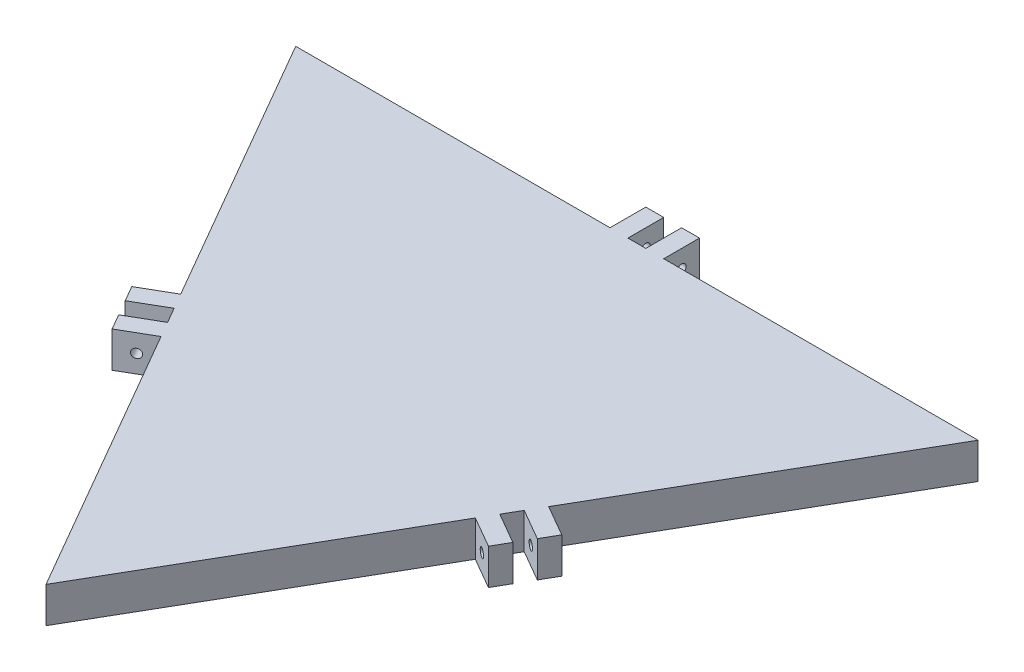
ISO-10303-21;
HEADER;
FILE_DESCRIPTION(('STEP AP214'),'2;1');
FILE_NAME('part.step','',(''),(''),'','','');
FILE_SCHEMA(('AUTOMOTIVE_DESIGN { 1 0 10303 214 1 1 1 1 }'));
ENDSEC;
DATA;
#1=APPLICATION_CONTEXT('core data for automotive mechanical design processes');
#2=APPLICATION_PROTOCOL_DEFINITION('international standard','automotive_design',2000,#1);
#3=PRODUCT_CONTEXT('',#1,'mechanical');
#4=PRODUCT('Part','Part','',(#3));
#5=PRODUCT_RELATED_PRODUCT_CATEGORY('part','',(#4));
#6=PRODUCT_DEFINITION_FORMATION('','',#4);
#7=PRODUCT_DEFINITION_CONTEXT('part definition',#1,'design');
#8=PRODUCT_DEFINITION('design','',#6,#7);
#9=PRODUCT_DEFINITION_SHAPE('','',#8);
#10=(LENGTH_UNIT() NAMED_UNIT(*) SI_UNIT(.MILLI.,.METRE.));
#11=(NAMED_UNIT(*) PLANE_ANGLE_UNIT() SI_UNIT($,.RADIAN.));
#12=(NAMED_UNIT(*) SI_UNIT($,.STERADIAN.) SOLID_ANGLE_UNIT());
#13=UNCERTAINTY_MEASURE_WITH_UNIT(LENGTH_MEASURE(1.E-05),#10,'distance_accuracy_value','');
#14=(GEOMETRIC_REPRESENTATION_CONTEXT(3) GLOBAL_UNCERTAINTY_ASSIGNED_CONTEXT((#13)) GLOBAL_UNIT_ASSIGNED_CONTEXT((#10,
#11,#12)) REPRESENTATION_CONTEXT('',''));
#15=CARTESIAN_POINT('',(0.,0.,0.));
#16=DIRECTION('',(0.,0.,1.));
#17=DIRECTION('',(1.,0.,0.));
#18=AXIS2_PLACEMENT_3D('',#15,#16,#17);
#19=CARTESIAN_POINT('',(-190.55,20.,-110.014093794083));
#20=DIRECTION('',(0.,0.,-1.));
#21=DIRECTION('',(-1.,0.,0.));
#22=AXIS2_PLACEMENT_3D('',#19,#20,#21);
#23=PLANE('',#22);
#24=DIRECTION('',(0.,-1.,0.));
#25=VECTOR('',#24,1.);
#26=CARTESIAN_POINT('',(4.99999999999988,20.,-110.014093794083));
#27=LINE('',#26,#25);
#28=CARTESIAN_POINT('',(4.99999999999987,20.,-110.014093794083));
#29=VERTEX_POINT('',#28);
#30=CARTESIAN_POINT('',(4.99999999999987,0.,-110.014093794083));
#31=VERTEX_POINT('',#30);
#32=EDGE_CURVE('E91',#29,#31,#27,.T.);
#33=ORIENTED_EDGE('',*,*,#32,.T.);
#34=DIRECTION('',(1.,0.,0.));
#35=VECTOR('',#34,1.);
#36=CARTESIAN_POINT('',(-190.55,0.,-110.014093794083));
#37=LINE('',#36,#35);
#38=CARTESIAN_POINT('',(-5.00000000000013,0.,-110.014093794083));
#39=VERTEX_POINT('',#38);
#40=EDGE_CURVE('E524',#39,#31,#37,.T.);
#41=ORIENTED_EDGE('',*,*,#40,.F.);
#42=DIRECTION('',(0.,1.,0.));
#43=VECTOR('',#42,1.);
#44=CARTESIAN_POINT('',(-5.00000000000013,20.,-110.014093794083));
#45=LINE('',#44,#43);
#46=CARTESIAN_POINT('',(-5.00000000000013,20.,-110.014093794083));
#47=VERTEX_POINT('',#46);
#48=EDGE_CURVE('E258',#39,#47,#45,.T.);
#49=ORIENTED_EDGE('',*,*,#48,.T.);
#50=DIRECTION('',(1.,0.,0.));
#51=VECTOR('',#50,1.);
#52=CARTESIAN_POINT('',(-190.55,20.,-110.014093794083));
#53=LINE('',#52,#51);
#54=EDGE_CURVE('E519',#47,#29,#53,.T.);
#55=ORIENTED_EDGE('',*,*,#54,.T.);
#56=EDGE_LOOP('',(#33,#41,#49,#55));
#57=FACE_BOUND('',#56,.T.);
#58=ADVANCED_FACE('F65',(#57),#23,.T.);
#59=DIRECTION('',(0.,1.,0.));
#60=VECTOR('',#59,1.);
#61=CARTESIAN_POINT('',(14.9999999999999,20.,-110.014093794083));
#62=LINE('',#61,#60);
#63=CARTESIAN_POINT('',(14.9999999999999,0.,-110.014093794083));
#64=VERTEX_POINT('',#63);
#65=CARTESIAN_POINT('',(14.9999999999999,20.,-110.014093794083));
#66=VERTEX_POINT('',#65);
#67=EDGE_CURVE('E270',#64,#66,#62,.T.);
#68=ORIENTED_EDGE('',*,*,#67,.T.);
#69=CARTESIAN_POINT('',(190.55,20.,-110.014093794083));
#70=VERTEX_POINT('',#69);
#71=EDGE_CURVE('E520',#66,#70,#53,.T.);
#72=ORIENTED_EDGE('',*,*,#71,.T.);
#73=DIRECTION('',(0.,-1.,0.));
#74=VECTOR('',#73,1.);
#75=CARTESIAN_POINT('',(190.55,20.,-110.014093794083));
#76=LINE('',#75,#74);
#77=CARTESIAN_POINT('',(190.55,0.,-110.014093794083));
#78=VERTEX_POINT('',#77);
#79=EDGE_CURVE('E69',#70,#78,#76,.T.);
#80=ORIENTED_EDGE('',*,*,#79,.T.);
#81=EDGE_CURVE('E83',#64,#78,#37,.T.);
#82=ORIENTED_EDGE('',*,*,#81,.F.);
#83=EDGE_LOOP('',(#68,#72,#80,#82));
#84=FACE_BOUND('',#83,.T.);
#85=ADVANCED_FACE('F67',(#84),#23,.T.);
#86=CARTESIAN_POINT('',(-190.55,20.,-110.014093794083));
#87=VERTEX_POINT('',#86);
#88=CARTESIAN_POINT('',(-15.0000000000001,20.,-110.014093794083));
#89=VERTEX_POINT('',#88);
#90=EDGE_CURVE('E514',#87,#89,#53,.T.);
#91=ORIENTED_EDGE('',*,*,#90,.T.);
#92=DIRECTION('',(0.,-1.,0.));
#93=VECTOR('',#92,1.);
#94=CARTESIAN_POINT('',(-15.0000000000001,20.,-110.014093794083));
#95=LINE('',#94,#93);
#96=CARTESIAN_POINT('',(-15.0000000000001,0.,-110.014093794083));
#97=VERTEX_POINT('',#96);
#98=EDGE_CURVE('E302',#89,#97,#95,.T.);
#99=ORIENTED_EDGE('',*,*,#98,.T.);
#100=CARTESIAN_POINT('',(-190.55,0.,-110.014093794083));
#101=VERTEX_POINT('',#100);
#102=EDGE_CURVE('E521',#101,#97,#37,.T.);
#103=ORIENTED_EDGE('',*,*,#102,.F.);
#104=DIRECTION('',(0.,-1.,0.));
#105=VECTOR('',#104,1.);
#106=CARTESIAN_POINT('',(-190.55,20.,-110.014093794083));
#107=LINE('',#106,#105);
#108=EDGE_CURVE('E518',#87,#101,#107,.T.);
#109=ORIENTED_EDGE('',*,*,#108,.F.);
#110=EDGE_LOOP('',(#91,#99,#103,#109));
#111=FACE_BOUND('',#110,.T.);
#112=ADVANCED_FACE('F592',(#111),#23,.T.);
#113=CARTESIAN_POINT('',(-95.275,20.,55.0070468970416));
#114=DIRECTION('',(-0.866025403784439,0.,0.5));
#115=DIRECTION('',(0.5,0.,0.866025403784439));
#116=AXIS2_PLACEMENT_3D('',#113,#114,#115);
#117=PLANE('',#116);
#118=DIRECTION('',(0.,-1.,0.));
#119=VECTOR('',#118,1.);
#120=CARTESIAN_POINT('',(-97.775,20.,50.6769198781195));
#121=LINE('',#120,#119);
#122=CARTESIAN_POINT('',(-97.7749999999999,20.,50.6769198781195));
#123=VERTEX_POINT('',#122);
#124=CARTESIAN_POINT('',(-97.7749999999999,0.,50.6769198781195));
#125=VERTEX_POINT('',#124);
#126=EDGE_CURVE('E332',#123,#125,#121,.T.);
#127=ORIENTED_EDGE('',*,*,#126,.T.);
#128=DIRECTION('',(-0.5,0.,-0.866025403784439));
#129=VECTOR('',#128,1.);
#130=CARTESIAN_POINT('',(-95.275,0.,55.0070468970416));
#131=LINE('',#130,#129);
#132=CARTESIAN_POINT('',(-92.775,0.,59.3371739159639));
#133=VERTEX_POINT('',#132);
#134=EDGE_CURVE('E512',#133,#125,#131,.T.);
#135=ORIENTED_EDGE('',*,*,#134,.F.);
#136=DIRECTION('',(0.,1.,0.));
#137=VECTOR('',#136,1.);
#138=CARTESIAN_POINT('',(-92.775,20.,59.3371739159639));
#139=LINE('',#138,#137);
#140=CARTESIAN_POINT('',(-92.775,20.,59.3371739159639));
#141=VERTEX_POINT('',#140);
#142=EDGE_CURVE('E371',#133,#141,#139,.T.);
#143=ORIENTED_EDGE('',*,*,#142,.T.);
#144=DIRECTION('',(-0.5,0.,-0.866025403784439));
#145=VECTOR('',#144,1.);
#146=CARTESIAN_POINT('',(-95.275,20.,55.0070468970416));
#147=LINE('',#146,#145);
#148=EDGE_CURVE('E502',#141,#123,#147,.T.);
#149=ORIENTED_EDGE('',*,*,#148,.T.);
#150=EDGE_LOOP('',(#127,#135,#143,#149));
#151=FACE_BOUND('',#150,.T.);
#152=ADVANCED_FACE('F598',(#151),#117,.T.);
#153=DIRECTION('',(0.,1.,0.));
#154=VECTOR('',#153,1.);
#155=CARTESIAN_POINT('',(-102.775,20.,42.0166658402751));
#156=LINE('',#155,#154);
#157=CARTESIAN_POINT('',(-102.775,0.,42.0166658402751));
#158=VERTEX_POINT('',#157);
#159=CARTESIAN_POINT('',(-102.775,20.,42.0166658402751));
#160=VERTEX_POINT('',#159);
#161=EDGE_CURVE('E338',#158,#160,#156,.T.);
#162=ORIENTED_EDGE('',*,*,#161,.T.);
#163=EDGE_CURVE('E496',#160,#87,#147,.T.);
#164=ORIENTED_EDGE('',*,*,#163,.T.);
#165=ORIENTED_EDGE('',*,*,#108,.T.);
#166=EDGE_CURVE('E506',#158,#101,#131,.T.);
#167=ORIENTED_EDGE('',*,*,#166,.F.);
#168=EDGE_LOOP('',(#162,#164,#165,#167));
#169=FACE_BOUND('',#168,.T.);
#170=ADVANCED_FACE('F603',(#169),#117,.T.);
#171=CARTESIAN_POINT('',(0.,20.,220.028187588166));
#172=VERTEX_POINT('',#171);
#173=CARTESIAN_POINT('',(-87.775,20.,67.9974279538083));
#174=VERTEX_POINT('',#173);
#175=EDGE_CURVE('E75',#172,#174,#147,.T.);
#176=ORIENTED_EDGE('',*,*,#175,.T.);
#177=DIRECTION('',(0.,-1.,0.));
#178=VECTOR('',#177,1.);
#179=CARTESIAN_POINT('',(-87.775,20.,67.9974279538083));
#180=LINE('',#179,#178);
#181=CARTESIAN_POINT('',(-87.7749999999999,0.,67.9974279538083));
#182=VERTEX_POINT('',#181);
#183=EDGE_CURVE('E377',#174,#182,#180,.T.);
#184=ORIENTED_EDGE('',*,*,#183,.T.);
#185=CARTESIAN_POINT('',(0.,0.,220.028187588166));
#186=VERTEX_POINT('',#185);
#187=EDGE_CURVE('E509',#186,#182,#131,.T.);
#188=ORIENTED_EDGE('',*,*,#187,.F.);
#189=DIRECTION('',(0.,-1.,0.));
#190=VECTOR('',#189,1.);
#191=CARTESIAN_POINT('',(0.,20.,220.028187588166));
#192=LINE('',#191,#190);
#193=EDGE_CURVE('E12',#172,#186,#192,.T.);
#194=ORIENTED_EDGE('',*,*,#193,.F.);
#195=EDGE_LOOP('',(#176,#184,#188,#194));
#196=FACE_BOUND('',#195,.T.);
#197=ADVANCED_FACE('F568',(#196),#117,.T.);
#198=CARTESIAN_POINT('',(95.275,20.,55.0070468970416));
#199=DIRECTION('',(-0.866025403784439,0.,-0.5));
#200=DIRECTION('',(-0.5,0.,0.866025403784439));
#201=AXIS2_PLACEMENT_3D('',#198,#199,#200);
#202=PLANE('',#201);
#203=DIRECTION('',(0.,-1.,0.));
#204=VECTOR('',#203,1.);
#205=CARTESIAN_POINT('',(97.775,20.,50.6769198781195));
#206=LINE('',#205,#204);
#207=CARTESIAN_POINT('',(97.775,20.,50.6769198781195));
#208=VERTEX_POINT('',#207);
#209=CARTESIAN_POINT('',(97.775,0.,50.6769198781195));
#210=VERTEX_POINT('',#209);
#211=EDGE_CURVE('E440',#208,#210,#206,.T.);
#212=ORIENTED_EDGE('',*,*,#211,.F.);
#213=DIRECTION('',(0.5,0.,-0.866025403784439));
#214=VECTOR('',#213,1.);
#215=CARTESIAN_POINT('',(95.275,20.,55.0070468970416));
#216=LINE('',#215,#214);
#217=CARTESIAN_POINT('',(92.775,20.,59.3371739159639));
#218=VERTEX_POINT('',#217);
#219=EDGE_CURVE('E497',#218,#208,#216,.T.);
#220=ORIENTED_EDGE('',*,*,#219,.F.);
#221=DIRECTION('',(0.,1.,0.));
#222=VECTOR('',#221,1.);
#223=CARTESIAN_POINT('',(92.775,20.,59.3371739159639));
#224=LINE('',#223,#222);
#225=CARTESIAN_POINT('',(92.775,0.,59.3371739159639));
#226=VERTEX_POINT('',#225);
#227=EDGE_CURVE('E445',#226,#218,#224,.T.);
#228=ORIENTED_EDGE('',*,*,#227,.F.);
#229=DIRECTION('',(0.5,0.,-0.866025403784439));
#230=VECTOR('',#229,1.);
#231=CARTESIAN_POINT('',(95.275,0.,55.0070468970416));
#232=LINE('',#231,#230);
#233=EDGE_CURVE('E507',#226,#210,#232,.T.);
#234=ORIENTED_EDGE('',*,*,#233,.T.);
#235=EDGE_LOOP('',(#212,#220,#228,#234));
#236=FACE_BOUND('',#235,.T.);
#237=ADVANCED_FACE('F542',(#236),#202,.F.);
#238=DIRECTION('',(0.,1.,0.));
#239=VECTOR('',#238,1.);
#240=CARTESIAN_POINT('',(102.775,20.,42.0166658402751));
#241=LINE('',#240,#239);
#242=CARTESIAN_POINT('',(102.775,0.,42.0166658402751));
#243=VERTEX_POINT('',#242);
#244=CARTESIAN_POINT('',(102.775,20.,42.0166658402751));
#245=VERTEX_POINT('',#244);
#246=EDGE_CURVE('E436',#243,#245,#241,.T.);
#247=ORIENTED_EDGE('',*,*,#246,.F.);
#248=EDGE_CURVE('E508',#243,#78,#232,.T.);
#249=ORIENTED_EDGE('',*,*,#248,.T.);
#250=ORIENTED_EDGE('',*,*,#79,.F.);
#251=EDGE_CURVE('E498',#245,#70,#216,.T.);
#252=ORIENTED_EDGE('',*,*,#251,.F.);
#253=EDGE_LOOP('',(#247,#249,#250,#252));
#254=FACE_BOUND('',#253,.T.);
#255=ADVANCED_FACE('F631',(#254),#202,.F.);
#256=DIRECTION('',(0.,-1.,0.));
#257=VECTOR('',#256,1.);
#258=CARTESIAN_POINT('',(87.775,20.,67.9974279538083));
#259=LINE('',#258,#257);
#260=CARTESIAN_POINT('',(87.775,20.,67.9974279538083));
#261=VERTEX_POINT('',#260);
#262=CARTESIAN_POINT('',(87.775,0.,67.9974279538083));
#263=VERTEX_POINT('',#262);
#264=EDGE_CURVE('E462',#261,#263,#259,.T.);
#265=ORIENTED_EDGE('',*,*,#264,.F.);
#266=EDGE_CURVE('E493',#172,#261,#216,.T.);
#267=ORIENTED_EDGE('',*,*,#266,.F.);
#268=ORIENTED_EDGE('',*,*,#193,.T.);
#269=EDGE_CURVE('E503',#186,#263,#232,.T.);
#270=ORIENTED_EDGE('',*,*,#269,.T.);
#271=EDGE_LOOP('',(#265,#267,#268,#270));
#272=FACE_BOUND('',#271,.T.);
#273=ADVANCED_FACE('F564',(#272),#202,.F.);
#274=CARTESIAN_POINT('',(0.,0.,0.));
#275=DIRECTION('',(0.,1.,0.));
#276=DIRECTION('',(0.,0.,1.));
#277=AXIS2_PLACEMENT_3D('',#274,#275,#276);
#278=PLANE('',#277);
#279=ORIENTED_EDGE('',*,*,#269,.F.);
#280=ORIENTED_EDGE('',*,*,#187,.T.);
#281=DIRECTION('',(0.866025403784438,0.,-0.5));
#282=VECTOR('',#281,1.);
#283=CARTESIAN_POINT('',(-105.095508075689,0.,77.9974279538083));
#284=LINE('',#283,#282);
#285=CARTESIAN_POINT('',(-105.095508075689,0.,77.9974279538083));
#286=VERTEX_POINT('',#285);
#287=EDGE_CURVE('E401',#286,#182,#284,.T.);
#288=ORIENTED_EDGE('',*,*,#287,.F.);
#289=DIRECTION('',(-0.500000000000001,0.,-0.866025403784438));
#290=VECTOR('',#289,1.);
#291=CARTESIAN_POINT('',(-110.095508075689,0.,69.3371739159639));
#292=LINE('',#291,#290);
#293=CARTESIAN_POINT('',(-110.095508075689,0.,69.3371739159639));
#294=VERTEX_POINT('',#293);
#295=EDGE_CURVE('E376',#286,#294,#292,.T.);
#296=ORIENTED_EDGE('',*,*,#295,.T.);
#297=DIRECTION('',(0.866025403784438,0.,-0.5));
#298=VECTOR('',#297,1.);
#299=CARTESIAN_POINT('',(-110.095508075689,0.,69.3371739159639));
#300=LINE('',#299,#298);
#301=EDGE_CURVE('E404',#294,#133,#300,.T.);
#302=ORIENTED_EDGE('',*,*,#301,.T.);
#303=ORIENTED_EDGE('',*,*,#134,.T.);
#304=DIRECTION('',(0.866025403784438,0.,-0.5));
#305=VECTOR('',#304,1.);
#306=CARTESIAN_POINT('',(-115.095508075689,0.,60.6769198781195));
#307=LINE('',#306,#305);
#308=CARTESIAN_POINT('',(-115.095508075689,0.,60.6769198781195));
#309=VERTEX_POINT('',#308);
#310=EDGE_CURVE('E350',#309,#125,#307,.T.);
#311=ORIENTED_EDGE('',*,*,#310,.F.);
#312=DIRECTION('',(-0.5,0.,-0.866025403784439));
#313=VECTOR('',#312,1.);
#314=CARTESIAN_POINT('',(-115.095508075689,0.,60.6769198781195));
#315=LINE('',#314,#313);
#316=CARTESIAN_POINT('',(-120.095508075689,0.,52.0166658402751));
#317=VERTEX_POINT('',#316);
#318=EDGE_CURVE('E346',#309,#317,#315,.T.);
#319=ORIENTED_EDGE('',*,*,#318,.T.);
#320=DIRECTION('',(0.866025403784438,0.,-0.5));
#321=VECTOR('',#320,1.);
#322=CARTESIAN_POINT('',(-120.095508075689,0.,52.0166658402751));
#323=LINE('',#322,#321);
#324=EDGE_CURVE('E359',#317,#158,#323,.T.);
#325=ORIENTED_EDGE('',*,*,#324,.T.);
#326=ORIENTED_EDGE('',*,*,#166,.T.);
#327=ORIENTED_EDGE('',*,*,#102,.T.);
#328=DIRECTION('',(0.,0.,1.));
#329=VECTOR('',#328,1.);
#330=CARTESIAN_POINT('',(-15.0000000000001,0.,-130.014093794083));
#331=LINE('',#330,#329);
#332=CARTESIAN_POINT('',(-15.0000000000001,0.,-130.014093794083));
#333=VERTEX_POINT('',#332);
#334=EDGE_CURVE('E326',#333,#97,#331,.T.);
#335=ORIENTED_EDGE('',*,*,#334,.F.);
#336=DIRECTION('',(1.,0.,0.));
#337=VECTOR('',#336,1.);
#338=CARTESIAN_POINT('',(-5.00000000000014,0.,-130.014093794083));
#339=LINE('',#338,#337);
#340=CARTESIAN_POINT('',(-5.00000000000014,0.,-130.014093794083));
#341=VERTEX_POINT('',#340);
#342=EDGE_CURVE('E301',#333,#341,#339,.T.);
#343=ORIENTED_EDGE('',*,*,#342,.T.);
#344=DIRECTION('',(0.,0.,1.));
#345=VECTOR('',#344,1.);
#346=CARTESIAN_POINT('',(-5.00000000000014,0.,-130.014093794083));
#347=LINE('',#346,#345);
#348=EDGE_CURVE('E329',#341,#39,#347,.T.);
#349=ORIENTED_EDGE('',*,*,#348,.T.);
#350=ORIENTED_EDGE('',*,*,#40,.T.);
#351=DIRECTION('',(0.,0.,1.));
#352=VECTOR('',#351,1.);
#353=CARTESIAN_POINT('',(4.99999999999987,0.,-130.014093794083));
#354=LINE('',#353,#352);
#355=CARTESIAN_POINT('',(4.99999999999987,0.,-130.014093794083));
#356=VERTEX_POINT('',#355);
#357=EDGE_CURVE('E284',#356,#31,#354,.T.);
#358=ORIENTED_EDGE('',*,*,#357,.F.);
#359=DIRECTION('',(1.,0.,0.));
#360=VECTOR('',#359,1.);
#361=CARTESIAN_POINT('',(4.99999999999987,0.,-130.014093794083));
#362=LINE('',#361,#360);
#363=CARTESIAN_POINT('',(14.9999999999999,0.,-130.014093794083));
#364=VERTEX_POINT('',#363);
#365=EDGE_CURVE('E268',#356,#364,#362,.T.);
#366=ORIENTED_EDGE('',*,*,#365,.T.);
#367=DIRECTION('',(0.,0.,1.));
#368=VECTOR('',#367,1.);
#369=CARTESIAN_POINT('',(14.9999999999999,0.,-130.014093794083));
#370=LINE('',#369,#368);
#371=EDGE_CURVE('E292',#364,#64,#370,.T.);
#372=ORIENTED_EDGE('',*,*,#371,.T.);
#373=ORIENTED_EDGE('',*,*,#81,.T.);
#374=ORIENTED_EDGE('',*,*,#248,.F.);
#375=DIRECTION('',(-0.866025403784438,0.,-0.5));
#376=VECTOR('',#375,1.);
#377=CARTESIAN_POINT('',(120.095508075689,0.,52.0166658402751));
#378=LINE('',#377,#376);
#379=CARTESIAN_POINT('',(120.095508075689,0.,52.0166658402751));
#380=VERTEX_POINT('',#379);
#381=EDGE_CURVE('E426',#380,#243,#378,.T.);
#382=ORIENTED_EDGE('',*,*,#381,.F.);
#383=DIRECTION('',(0.5,0.,-0.866025403784439));
#384=VECTOR('',#383,1.);
#385=CARTESIAN_POINT('',(115.095508075689,0.,60.6769198781195));
#386=LINE('',#385,#384);
#387=CARTESIAN_POINT('',(115.095508075689,0.,60.6769198781195));
#388=VERTEX_POINT('',#387);
#389=EDGE_CURVE('E451',#388,#380,#386,.T.);
#390=ORIENTED_EDGE('',*,*,#389,.F.);
#391=DIRECTION('',(-0.866025403784438,0.,-0.5));
#392=VECTOR('',#391,1.);
#393=CARTESIAN_POINT('',(115.095508075689,0.,60.6769198781195));
#394=LINE('',#393,#392);
#395=EDGE_CURVE('E423',#388,#210,#394,.T.);
#396=ORIENTED_EDGE('',*,*,#395,.T.);
#397=ORIENTED_EDGE('',*,*,#233,.F.);
#398=DIRECTION('',(-0.866025403784438,0.,-0.5));
#399=VECTOR('',#398,1.);
#400=CARTESIAN_POINT('',(110.095508075689,0.,69.3371739159639));
#401=LINE('',#400,#399);
#402=CARTESIAN_POINT('',(110.095508075689,0.,69.3371739159639));
#403=VERTEX_POINT('',#402);
#404=EDGE_CURVE('E471',#403,#226,#401,.T.);
#405=ORIENTED_EDGE('',*,*,#404,.F.);
#406=DIRECTION('',(0.500000000000001,0.,-0.866025403784438));
#407=VECTOR('',#406,1.);
#408=CARTESIAN_POINT('',(110.095508075689,0.,69.3371739159639));
#409=LINE('',#408,#407);
#410=CARTESIAN_POINT('',(105.095508075689,0.,77.9974279538083));
#411=VERTEX_POINT('',#410);
#412=EDGE_CURVE('E468',#411,#403,#409,.T.);
#413=ORIENTED_EDGE('',*,*,#412,.F.);
#414=DIRECTION('',(-0.866025403784438,0.,-0.5));
#415=VECTOR('',#414,1.);
#416=CARTESIAN_POINT('',(105.095508075689,0.,77.9974279538083));
#417=LINE('',#416,#415);
#418=EDGE_CURVE('E481',#411,#263,#417,.T.);
#419=ORIENTED_EDGE('',*,*,#418,.T.);
#420=EDGE_LOOP('',(#279,#280,#288,#296,#302,#303,#311,#319,#325,#326,#327,#335,#343,#349,#350,
#358,#366,#372,#373,#374,#382,#390,#396,#397,#405,#413,#419));
#421=FACE_BOUND('',#420,.T.);
#422=ADVANCED_FACE('F547',(#421),#278,.F.);
#423=CARTESIAN_POINT('',(0.,20.,0.));
#424=DIRECTION('',(0.,1.,0.));
#425=DIRECTION('',(0.,0.,1.));
#426=AXIS2_PLACEMENT_3D('',#423,#424,#425);
#427=PLANE('',#426);
#428=ORIENTED_EDGE('',*,*,#266,.T.);
#429=DIRECTION('',(-0.866025403784438,0.,-0.5));
#430=VECTOR('',#429,1.);
#431=CARTESIAN_POINT('',(105.095508075689,20.,77.9974279538083));
#432=LINE('',#431,#430);
#433=CARTESIAN_POINT('',(105.095508075689,20.,77.9974279538083));
#434=VERTEX_POINT('',#433);
#435=EDGE_CURVE('E485',#434,#261,#432,.T.);
#436=ORIENTED_EDGE('',*,*,#435,.F.);
#437=DIRECTION('',(-0.5,0.,0.866025403784439));
#438=VECTOR('',#437,1.);
#439=CARTESIAN_POINT('',(110.095508075689,20.,69.3371739159639));
#440=LINE('',#439,#438);
#441=CARTESIAN_POINT('',(110.095508075689,20.,69.3371739159639));
#442=VERTEX_POINT('',#441);
#443=EDGE_CURVE('E461',#442,#434,#440,.T.);
#444=ORIENTED_EDGE('',*,*,#443,.F.);
#445=DIRECTION('',(-0.866025403784438,0.,-0.5));
#446=VECTOR('',#445,1.);
#447=CARTESIAN_POINT('',(110.095508075689,20.,69.3371739159639));
#448=LINE('',#447,#446);
#449=EDGE_CURVE('E489',#442,#218,#448,.T.);
#450=ORIENTED_EDGE('',*,*,#449,.T.);
#451=ORIENTED_EDGE('',*,*,#219,.T.);
#452=DIRECTION('',(-0.866025403784438,0.,-0.5));
#453=VECTOR('',#452,1.);
#454=CARTESIAN_POINT('',(115.095508075689,20.,60.6769198781195));
#455=LINE('',#454,#453);
#456=CARTESIAN_POINT('',(115.095508075689,20.,60.6769198781195));
#457=VERTEX_POINT('',#456);
#458=EDGE_CURVE('E432',#457,#208,#455,.T.);
#459=ORIENTED_EDGE('',*,*,#458,.F.);
#460=DIRECTION('',(-0.5,0.,0.866025403784439));
#461=VECTOR('',#460,1.);
#462=CARTESIAN_POINT('',(115.095508075689,20.,60.6769198781195));
#463=LINE('',#462,#461);
#464=CARTESIAN_POINT('',(120.095508075689,20.,52.0166658402751));
#465=VERTEX_POINT('',#464);
#466=EDGE_CURVE('E435',#465,#457,#463,.T.);
#467=ORIENTED_EDGE('',*,*,#466,.F.);
#468=DIRECTION('',(-0.866025403784438,0.,-0.5));
#469=VECTOR('',#468,1.);
#470=CARTESIAN_POINT('',(120.095508075689,20.,52.0166658402751));
#471=LINE('',#470,#469);
#472=EDGE_CURVE('E429',#465,#245,#471,.T.);
#473=ORIENTED_EDGE('',*,*,#472,.T.);
#474=ORIENTED_EDGE('',*,*,#251,.T.);
#475=ORIENTED_EDGE('',*,*,#71,.F.);
#476=DIRECTION('',(0.,0.,1.));
#477=VECTOR('',#476,1.);
#478=CARTESIAN_POINT('',(14.9999999999999,20.,-130.014093794083));
#479=LINE('',#478,#477);
#480=CARTESIAN_POINT('',(14.9999999999999,20.,-130.014093794083));
#481=VERTEX_POINT('',#480);
#482=EDGE_CURVE('E259',#481,#66,#479,.T.);
#483=ORIENTED_EDGE('',*,*,#482,.F.);
#484=DIRECTION('',(-1.,0.,0.));
#485=VECTOR('',#484,1.);
#486=CARTESIAN_POINT('',(4.99999999999987,20.,-130.014093794083));
#487=LINE('',#486,#485);
#488=CARTESIAN_POINT('',(4.99999999999987,20.,-130.014093794083));
#489=VERTEX_POINT('',#488);
#490=EDGE_CURVE('E265',#481,#489,#487,.T.);
#491=ORIENTED_EDGE('',*,*,#490,.T.);
#492=DIRECTION('',(0.,0.,1.));
#493=VECTOR('',#492,1.);
#494=CARTESIAN_POINT('',(4.99999999999987,20.,-130.014093794083));
#495=LINE('',#494,#493);
#496=EDGE_CURVE('E248',#489,#29,#495,.T.);
#497=ORIENTED_EDGE('',*,*,#496,.T.);
#498=ORIENTED_EDGE('',*,*,#54,.F.);
#499=DIRECTION('',(0.,0.,1.));
#500=VECTOR('',#499,1.);
#501=CARTESIAN_POINT('',(-5.00000000000014,20.,-130.014093794083));
#502=LINE('',#501,#500);
#503=CARTESIAN_POINT('',(-5.00000000000014,20.,-130.014093794083));
#504=VERTEX_POINT('',#503);
#505=EDGE_CURVE('E314',#504,#47,#502,.T.);
#506=ORIENTED_EDGE('',*,*,#505,.F.);
#507=DIRECTION('',(-1.,0.,0.));
#508=VECTOR('',#507,1.);
#509=CARTESIAN_POINT('',(-5.00000000000014,20.,-130.014093794083));
#510=LINE('',#509,#508);
#511=CARTESIAN_POINT('',(-15.0000000000001,20.,-130.014093794083));
#512=VERTEX_POINT('',#511);
#513=EDGE_CURVE('E310',#504,#512,#510,.T.);
#514=ORIENTED_EDGE('',*,*,#513,.T.);
#515=DIRECTION('',(0.,0.,1.));
#516=VECTOR('',#515,1.);
#517=CARTESIAN_POINT('',(-15.0000000000001,20.,-130.014093794083));
#518=LINE('',#517,#516);
#519=EDGE_CURVE('E323',#512,#89,#518,.T.);
#520=ORIENTED_EDGE('',*,*,#519,.T.);
#521=ORIENTED_EDGE('',*,*,#90,.F.);
#522=ORIENTED_EDGE('',*,*,#163,.F.);
#523=DIRECTION('',(0.866025403784438,0.,-0.5));
#524=VECTOR('',#523,1.);
#525=CARTESIAN_POINT('',(-120.095508075689,20.,52.0166658402751));
#526=LINE('',#525,#524);
#527=CARTESIAN_POINT('',(-120.095508075689,20.,52.0166658402751));
#528=VERTEX_POINT('',#527);
#529=EDGE_CURVE('E363',#528,#160,#526,.T.);
#530=ORIENTED_EDGE('',*,*,#529,.F.);
#531=DIRECTION('',(0.5,0.,0.866025403784439));
#532=VECTOR('',#531,1.);
#533=CARTESIAN_POINT('',(-115.095508075689,20.,60.6769198781195));
#534=LINE('',#533,#532);
#535=CARTESIAN_POINT('',(-115.095508075689,20.,60.6769198781195));
#536=VERTEX_POINT('',#535);
#537=EDGE_CURVE('E337',#528,#536,#534,.T.);
#538=ORIENTED_EDGE('',*,*,#537,.T.);
#539=DIRECTION('',(0.866025403784438,0.,-0.5));
#540=VECTOR('',#539,1.);
#541=CARTESIAN_POINT('',(-115.095508075689,20.,60.6769198781195));
#542=LINE('',#541,#540);
#543=EDGE_CURVE('E367',#536,#123,#542,.T.);
#544=ORIENTED_EDGE('',*,*,#543,.T.);
#545=ORIENTED_EDGE('',*,*,#148,.F.);
#546=DIRECTION('',(0.866025403784438,0.,-0.5));
#547=VECTOR('',#546,1.);
#548=CARTESIAN_POINT('',(-110.095508075689,20.,69.3371739159639));
#549=LINE('',#548,#547);
#550=CARTESIAN_POINT('',(-110.095508075689,20.,69.3371739159639));
#551=VERTEX_POINT('',#550);
#552=EDGE_CURVE('E389',#551,#141,#549,.T.);
#553=ORIENTED_EDGE('',*,*,#552,.F.);
#554=DIRECTION('',(0.5,0.,0.866025403784439));
#555=VECTOR('',#554,1.);
#556=CARTESIAN_POINT('',(-110.095508075689,20.,69.3371739159639));
#557=LINE('',#556,#555);
#558=CARTESIAN_POINT('',(-105.095508075689,20.,77.9974279538083));
#559=VERTEX_POINT('',#558);
#560=EDGE_CURVE('E385',#551,#559,#557,.T.);
#561=ORIENTED_EDGE('',*,*,#560,.T.);
#562=DIRECTION('',(0.866025403784438,0.,-0.5));
#563=VECTOR('',#562,1.);
#564=CARTESIAN_POINT('',(-105.095508075689,20.,77.9974279538083));
#565=LINE('',#564,#563);
#566=EDGE_CURVE('E398',#559,#174,#565,.T.);
#567=ORIENTED_EDGE('',*,*,#566,.T.);
#568=ORIENTED_EDGE('',*,*,#175,.F.);
#569=EDGE_LOOP('',(#428,#436,#444,#450,#451,#459,#467,#473,#474,#475,#483,#491,#497,#498,#506,
#514,#520,#521,#522,#530,#538,#544,#545,#553,#561,#567,#568));
#570=FACE_BOUND('',#569,.T.);
#571=ADVANCED_FACE('F273',(#570),#427,.T.);
#572=CARTESIAN_POINT('',(110.095508075689,20.,69.3371739159639));
#573=DIRECTION('',(-0.5,0.,0.866025403784438));
#574=DIRECTION('',(0.866025403784438,0.,0.5));
#575=AXIS2_PLACEMENT_3D('',#572,#573,#574);
#576=PLANE('',#575);
#577=CARTESIAN_POINT('',(101.435254037844,9.99999999999999,64.3371739159639));
#578=DIRECTION('',(-0.5,0.,0.866025403784438));
#579=DIRECTION('',(0.866025403784438,0.,0.5));
#580=AXIS2_PLACEMENT_3D('',#577,#578,#579);
#581=CIRCLE('',#580,2.49999999999998);
#582=CARTESIAN_POINT('',(103.600317547305,9.99999999999999,65.5871739159639));
#583=VERTEX_POINT('',#582);
#584=EDGE_CURVE('E419',#583,#583,#581,.T.);
#585=ORIENTED_EDGE('',*,*,#584,.T.);
#586=EDGE_LOOP('',(#585));
#587=FACE_BOUND('',#586,.T.);
#588=ORIENTED_EDGE('',*,*,#227,.T.);
#589=ORIENTED_EDGE('',*,*,#449,.F.);
#590=DIRECTION('',(0.,1.,0.));
#591=VECTOR('',#590,1.);
#592=CARTESIAN_POINT('',(110.095508075689,20.,69.3371739159639));
#593=LINE('',#592,#591);
#594=EDGE_CURVE('E457',#403,#442,#593,.T.);
#595=ORIENTED_EDGE('',*,*,#594,.F.);
#596=ORIENTED_EDGE('',*,*,#404,.T.);
#597=EDGE_LOOP('',(#588,#589,#595,#596));
#598=FACE_BOUND('',#597,.T.);
#599=ADVANCED_FACE('F552',(#587,#598),#576,.F.);
#600=CARTESIAN_POINT('',(105.095508075689,20.,77.9974279538083));
#601=DIRECTION('',(0.5,0.,-0.866025403784438));
#602=DIRECTION('',(-0.866025403784438,0.,-0.5));
#603=AXIS2_PLACEMENT_3D('',#600,#601,#602);
#604=PLANE('',#603);
#605=CARTESIAN_POINT('',(96.4352540378443,10.,72.9974279538083));
#606=DIRECTION('',(-0.5,0.,0.866025403784438));
#607=DIRECTION('',(0.866025403784439,0.,0.5));
#608=AXIS2_PLACEMENT_3D('',#605,#606,#607);
#609=CIRCLE('',#608,2.49999999999998);
#610=CARTESIAN_POINT('',(98.6003175473054,10.,74.2474279538083));
#611=VERTEX_POINT('',#610);
#612=EDGE_CURVE('E407',#611,#611,#609,.T.);
#613=ORIENTED_EDGE('',*,*,#612,.F.);
#614=EDGE_LOOP('',(#613));
#615=FACE_BOUND('',#614,.T.);
#616=ORIENTED_EDGE('',*,*,#264,.T.);
#617=ORIENTED_EDGE('',*,*,#418,.F.);
#618=DIRECTION('',(0.,-1.,0.));
#619=VECTOR('',#618,1.);
#620=CARTESIAN_POINT('',(105.095508075689,20.,77.9974279538083));
#621=LINE('',#620,#619);
#622=EDGE_CURVE('E465',#434,#411,#621,.T.);
#623=ORIENTED_EDGE('',*,*,#622,.F.);
#624=ORIENTED_EDGE('',*,*,#435,.T.);
#625=EDGE_LOOP('',(#616,#617,#623,#624));
#626=FACE_BOUND('',#625,.T.);
#627=ADVANCED_FACE('F561',(#615,#626),#604,.F.);
#628=CARTESIAN_POINT('',(112.595508075689,0.,65.0070468970417));
#629=DIRECTION('',(-0.866025403784438,0.,-0.500000000000001));
#630=DIRECTION('',(-0.500000000000001,0.,0.866025403784438));
#631=AXIS2_PLACEMENT_3D('',#628,#629,#630);
#632=PLANE('',#631);
#633=ORIENTED_EDGE('',*,*,#594,.T.);
#634=ORIENTED_EDGE('',*,*,#443,.T.);
#635=ORIENTED_EDGE('',*,*,#622,.T.);
#636=ORIENTED_EDGE('',*,*,#412,.T.);
#637=EDGE_LOOP('',(#633,#634,#635,#636));
#638=FACE_BOUND('',#637,.T.);
#639=ADVANCED_FACE('F555',(#638),#632,.F.);
#640=CARTESIAN_POINT('',(115.095508075689,20.,60.6769198781195));
#641=DIRECTION('',(0.5,0.,-0.866025403784438));
#642=DIRECTION('',(-0.866025403784438,0.,-0.5));
#643=AXIS2_PLACEMENT_3D('',#640,#641,#642);
#644=PLANE('',#643);
#645=CARTESIAN_POINT('',(106.435254037844,9.99999999999999,55.6769198781195));
#646=DIRECTION('',(0.5,0.,-0.866025403784438));
#647=DIRECTION('',(-0.866025403784438,0.,-0.5));
#648=AXIS2_PLACEMENT_3D('',#645,#646,#647);
#649=CIRCLE('',#648,2.49999999999998);
#650=CARTESIAN_POINT('',(104.270190528383,9.99999999999999,54.4269198781195));
#651=VERTEX_POINT('',#650);
#652=EDGE_CURVE('E415',#651,#651,#649,.T.);
#653=ORIENTED_EDGE('',*,*,#652,.T.);
#654=EDGE_LOOP('',(#653));
#655=FACE_BOUND('',#654,.T.);
#656=ORIENTED_EDGE('',*,*,#211,.T.);
#657=ORIENTED_EDGE('',*,*,#395,.F.);
#658=DIRECTION('',(0.,-1.,0.));
#659=VECTOR('',#658,1.);
#660=CARTESIAN_POINT('',(115.095508075689,20.,60.6769198781195));
#661=LINE('',#660,#659);
#662=EDGE_CURVE('E441',#457,#388,#661,.T.);
#663=ORIENTED_EDGE('',*,*,#662,.F.);
#664=ORIENTED_EDGE('',*,*,#458,.T.);
#665=EDGE_LOOP('',(#656,#657,#663,#664));
#666=FACE_BOUND('',#665,.T.);
#667=ADVANCED_FACE('F651',(#655,#666),#644,.F.);
#668=CARTESIAN_POINT('',(120.095508075689,20.,52.0166658402751));
#669=DIRECTION('',(-0.5,0.,0.866025403784438));
#670=DIRECTION('',(0.866025403784438,0.,0.5));
#671=AXIS2_PLACEMENT_3D('',#668,#669,#670);
#672=PLANE('',#671);
#673=CARTESIAN_POINT('',(111.435254037844,9.99999999999999,47.0166658402751));
#674=DIRECTION('',(-0.5,0.,0.866025403784438));
#675=DIRECTION('',(0.866025403784438,0.,0.5));
#676=AXIS2_PLACEMENT_3D('',#673,#674,#675);
#677=CIRCLE('',#676,2.49999999999998);
#678=CARTESIAN_POINT('',(113.600317547305,9.99999999999999,48.2666658402751));
#679=VERTEX_POINT('',#678);
#680=EDGE_CURVE('E411',#679,#679,#677,.F.);
#681=ORIENTED_EDGE('',*,*,#680,.F.);
#682=EDGE_LOOP('',(#681));
#683=FACE_BOUND('',#682,.T.);
#684=ORIENTED_EDGE('',*,*,#246,.T.);
#685=ORIENTED_EDGE('',*,*,#472,.F.);
#686=DIRECTION('',(0.,1.,0.));
#687=VECTOR('',#686,1.);
#688=CARTESIAN_POINT('',(120.095508075689,20.,52.0166658402751));
#689=LINE('',#688,#687);
#690=EDGE_CURVE('E448',#380,#465,#689,.T.);
#691=ORIENTED_EDGE('',*,*,#690,.F.);
#692=ORIENTED_EDGE('',*,*,#381,.T.);
#693=EDGE_LOOP('',(#684,#685,#691,#692));
#694=FACE_BOUND('',#693,.T.);
#695=ADVANCED_FACE('F656',(#683,#694),#672,.F.);
#696=CARTESIAN_POINT('',(112.595508075689,0.,65.0070468970416));
#697=DIRECTION('',(0.866025403784439,0.,0.5));
#698=DIRECTION('',(0.5,0.,-0.866025403784439));
#699=AXIS2_PLACEMENT_3D('',#696,#697,#698);
#700=PLANE('',#699);
#701=ORIENTED_EDGE('',*,*,#662,.T.);
#702=ORIENTED_EDGE('',*,*,#389,.T.);
#703=ORIENTED_EDGE('',*,*,#690,.T.);
#704=ORIENTED_EDGE('',*,*,#466,.T.);
#705=EDGE_LOOP('',(#701,#702,#703,#704));
#706=FACE_BOUND('',#705,.T.);
#707=ADVANCED_FACE('F652',(#706),#700,.T.);
#708=CARTESIAN_POINT('',(114.970787943777,9.99999999999999,40.8929414833172));
#709=DIRECTION('',(-0.5,0.,0.866025403784438));
#710=DIRECTION('',(0.866025403784438,0.,0.5));
#711=AXIS2_PLACEMENT_3D('',#708,#709,#710);
#712=CYLINDRICAL_SURFACE('',#711,2.49999999999998);
#713=ORIENTED_EDGE('',*,*,#680,.T.);
#714=EDGE_LOOP('',(#713));
#715=FACE_BOUND('',#714,.T.);
#716=ORIENTED_EDGE('',*,*,#652,.F.);
#717=EDGE_LOOP('',(#716));
#718=FACE_BOUND('',#717,.T.);
#719=ADVANCED_FACE('F655',(#715,#718),#712,.F.);
#720=ORIENTED_EDGE('',*,*,#612,.T.);
#721=EDGE_LOOP('',(#720));
#722=FACE_BOUND('',#721,.T.);
#723=ORIENTED_EDGE('',*,*,#584,.F.);
#724=EDGE_LOOP('',(#723));
#725=FACE_BOUND('',#724,.T.);
#726=ADVANCED_FACE('F587',(#722,#725),#712,.F.);
#727=CARTESIAN_POINT('',(-110.095508075689,20.,69.3371739159639));
#728=DIRECTION('',(-0.5,0.,-0.866025403784438));
#729=DIRECTION('',(-0.866025403784438,0.,0.5));
#730=AXIS2_PLACEMENT_3D('',#727,#728,#729);
#731=PLANE('',#730);
#732=CARTESIAN_POINT('',(-101.435254037844,9.99999999999999,64.3371739159639));
#733=DIRECTION('',(-0.5,0.,-0.866025403784438));
#734=DIRECTION('',(-0.866025403784438,0.,0.5));
#735=AXIS2_PLACEMENT_3D('',#732,#733,#734);
#736=CIRCLE('',#735,2.49999999999998);
#737=CARTESIAN_POINT('',(-103.600317547305,9.99999999999999,65.5871739159639));
#738=VERTEX_POINT('',#737);
#739=EDGE_CURVE('E287',#738,#738,#736,.F.);
#740=ORIENTED_EDGE('',*,*,#739,.T.);
#741=EDGE_LOOP('',(#740));
#742=FACE_BOUND('',#741,.T.);
#743=ORIENTED_EDGE('',*,*,#142,.F.);
#744=ORIENTED_EDGE('',*,*,#301,.F.);
#745=DIRECTION('',(0.,1.,0.));
#746=VECTOR('',#745,1.);
#747=CARTESIAN_POINT('',(-110.095508075689,20.,69.3371739159639));
#748=LINE('',#747,#746);
#749=EDGE_CURVE('E372',#294,#551,#748,.T.);
#750=ORIENTED_EDGE('',*,*,#749,.T.);
#751=ORIENTED_EDGE('',*,*,#552,.T.);
#752=EDGE_LOOP('',(#743,#744,#750,#751));
#753=FACE_BOUND('',#752,.T.);
#754=ADVANCED_FACE('F578',(#742,#753),#731,.T.);
#755=CARTESIAN_POINT('',(-105.095508075689,20.,77.9974279538083));
#756=DIRECTION('',(0.5,0.,0.866025403784438));
#757=DIRECTION('',(0.866025403784438,0.,-0.5));
#758=AXIS2_PLACEMENT_3D('',#755,#756,#757);
#759=PLANE('',#758);
#760=CARTESIAN_POINT('',(-96.4352540378443,10.,72.9974279538083));
#761=DIRECTION('',(-0.5,0.,-0.866025403784438));
#762=DIRECTION('',(-0.866025403784439,0.,0.5));
#763=AXIS2_PLACEMENT_3D('',#760,#761,#762);
#764=CIRCLE('',#763,2.49999999999998);
#765=CARTESIAN_POINT('',(-98.6003175473054,10.,74.2474279538083));
#766=VERTEX_POINT('',#765);
#767=EDGE_CURVE('E764',#766,#766,#764,.T.);
#768=ORIENTED_EDGE('',*,*,#767,.T.);
#769=EDGE_LOOP('',(#768));
#770=FACE_BOUND('',#769,.T.);
#771=ORIENTED_EDGE('',*,*,#183,.F.);
#772=ORIENTED_EDGE('',*,*,#566,.F.);
#773=DIRECTION('',(0.,-1.,0.));
#774=VECTOR('',#773,1.);
#775=CARTESIAN_POINT('',(-105.095508075689,20.,77.9974279538083));
#776=LINE('',#775,#774);
#777=EDGE_CURVE('E381',#559,#286,#776,.T.);
#778=ORIENTED_EDGE('',*,*,#777,.T.);
#779=ORIENTED_EDGE('',*,*,#287,.T.);
#780=EDGE_LOOP('',(#771,#772,#778,#779));
#781=FACE_BOUND('',#780,.T.);
#782=ADVANCED_FACE('F576',(#770,#781),#759,.T.);
#783=CARTESIAN_POINT('',(-112.595508075689,0.,65.0070468970417));
#784=DIRECTION('',(0.866025403784438,0.,-0.500000000000001));
#785=DIRECTION('',(0.500000000000001,0.,0.866025403784438));
#786=AXIS2_PLACEMENT_3D('',#783,#784,#785);
#787=PLANE('',#786);
#788=ORIENTED_EDGE('',*,*,#749,.F.);
#789=ORIENTED_EDGE('',*,*,#295,.F.);
#790=ORIENTED_EDGE('',*,*,#777,.F.);
#791=ORIENTED_EDGE('',*,*,#560,.F.);
#792=EDGE_LOOP('',(#788,#789,#790,#791));
#793=FACE_BOUND('',#792,.T.);
#794=ADVANCED_FACE('F574',(#793),#787,.F.);
#795=CARTESIAN_POINT('',(-115.095508075689,20.,60.6769198781195));
#796=DIRECTION('',(0.5,0.,0.866025403784438));
#797=DIRECTION('',(0.866025403784438,0.,-0.5));
#798=AXIS2_PLACEMENT_3D('',#795,#796,#797);
#799=PLANE('',#798);
#800=CARTESIAN_POINT('',(-106.435254037844,9.99999999999999,55.6769198781195));
#801=DIRECTION('',(0.5,0.,0.866025403784438));
#802=DIRECTION('',(0.866025403784438,0.,-0.5));
#803=AXIS2_PLACEMENT_3D('',#800,#801,#802);
#804=CIRCLE('',#803,2.49999999999998);
#805=CARTESIAN_POINT('',(-104.270190528383,9.99999999999999,54.4269198781195));
#806=VERTEX_POINT('',#805);
#807=EDGE_CURVE('E771',#806,#806,#804,.F.);
#808=ORIENTED_EDGE('',*,*,#807,.T.);
#809=EDGE_LOOP('',(#808));
#810=FACE_BOUND('',#809,.T.);
#811=ORIENTED_EDGE('',*,*,#126,.F.);
#812=ORIENTED_EDGE('',*,*,#543,.F.);
#813=DIRECTION('',(0.,-1.,0.));
#814=VECTOR('',#813,1.);
#815=CARTESIAN_POINT('',(-115.095508075689,20.,60.6769198781195));
#816=LINE('',#815,#814);
#817=EDGE_CURVE('E333',#536,#309,#816,.T.);
#818=ORIENTED_EDGE('',*,*,#817,.T.);
#819=ORIENTED_EDGE('',*,*,#310,.T.);
#820=EDGE_LOOP('',(#811,#812,#818,#819));
#821=FACE_BOUND('',#820,.T.);
#822=ADVANCED_FACE('F585',(#810,#821),#799,.T.);
#823=CARTESIAN_POINT('',(-120.095508075689,20.,52.0166658402751));
#824=DIRECTION('',(-0.5,0.,-0.866025403784438));
#825=DIRECTION('',(-0.866025403784438,0.,0.5));
#826=AXIS2_PLACEMENT_3D('',#823,#824,#825);
#827=PLANE('',#826);
#828=CARTESIAN_POINT('',(-111.435254037844,9.99999999999999,47.0166658402751));
#829=DIRECTION('',(0.5,0.,0.866025403784438));
#830=DIRECTION('',(0.866025403784438,0.,-0.5));
#831=AXIS2_PLACEMENT_3D('',#828,#829,#830);
#832=CIRCLE('',#831,2.49999999999998);
#833=CARTESIAN_POINT('',(-109.270190528383,9.99999999999999,45.7666658402751));
#834=VERTEX_POINT('',#833);
#835=EDGE_CURVE('E767',#834,#834,#832,.T.);
#836=ORIENTED_EDGE('',*,*,#835,.T.);
#837=EDGE_LOOP('',(#836));
#838=FACE_BOUND('',#837,.T.);
#839=ORIENTED_EDGE('',*,*,#161,.F.);
#840=ORIENTED_EDGE('',*,*,#324,.F.);
#841=DIRECTION('',(0.,1.,0.));
#842=VECTOR('',#841,1.);
#843=CARTESIAN_POINT('',(-120.095508075689,20.,52.0166658402751));
#844=LINE('',#843,#842);
#845=EDGE_CURVE('E342',#317,#528,#844,.T.);
#846=ORIENTED_EDGE('',*,*,#845,.T.);
#847=ORIENTED_EDGE('',*,*,#529,.T.);
#848=EDGE_LOOP('',(#839,#840,#846,#847));
#849=FACE_BOUND('',#848,.T.);
#850=ADVANCED_FACE('F687',(#838,#849),#827,.T.);
#851=CARTESIAN_POINT('',(-112.595508075689,0.,65.0070468970416));
#852=DIRECTION('',(-0.866025403784439,0.,0.5));
#853=DIRECTION('',(-0.5,0.,-0.866025403784439));
#854=AXIS2_PLACEMENT_3D('',#851,#852,#853);
#855=PLANE('',#854);
#856=ORIENTED_EDGE('',*,*,#817,.F.);
#857=ORIENTED_EDGE('',*,*,#537,.F.);
#858=ORIENTED_EDGE('',*,*,#845,.F.);
#859=ORIENTED_EDGE('',*,*,#318,.F.);
#860=EDGE_LOOP('',(#856,#857,#858,#859));
#861=FACE_BOUND('',#860,.T.);
#862=ADVANCED_FACE('F692',(#861),#855,.T.);
#863=CARTESIAN_POINT('',(-5.00000000000014,20.,-130.014093794083));
#864=DIRECTION('',(1.,0.,0.));
#865=DIRECTION('',(0.,0.,-1.));
#866=AXIS2_PLACEMENT_3D('',#863,#864,#865);
#867=PLANE('',#866);
#868=CARTESIAN_POINT('',(-5.00000000000014,9.99999999999999,-120.014093794083));
#869=DIRECTION('',(1.,0.,0.));
#870=DIRECTION('',(0.,0.,-1.));
#871=AXIS2_PLACEMENT_3D('',#868,#869,#870);
#872=CIRCLE('',#871,2.49999999999998);
#873=CARTESIAN_POINT('',(-5.00000000000014,9.99999999999999,-122.514093794083));
#874=VERTEX_POINT('',#873);
#875=EDGE_CURVE('E756',#874,#874,#872,.F.);
#876=ORIENTED_EDGE('',*,*,#875,.T.);
#877=EDGE_LOOP('',(#876));
#878=FACE_BOUND('',#877,.T.);
#879=ORIENTED_EDGE('',*,*,#48,.F.);
#880=ORIENTED_EDGE('',*,*,#348,.F.);
#881=DIRECTION('',(0.,1.,0.));
#882=VECTOR('',#881,1.);
#883=CARTESIAN_POINT('',(-5.00000000000014,20.,-130.014093794083));
#884=LINE('',#883,#882);
#885=EDGE_CURVE('E297',#341,#504,#884,.T.);
#886=ORIENTED_EDGE('',*,*,#885,.T.);
#887=ORIENTED_EDGE('',*,*,#505,.T.);
#888=EDGE_LOOP('',(#879,#880,#886,#887));
#889=FACE_BOUND('',#888,.T.);
#890=ADVANCED_FACE('F618',(#878,#889),#867,.T.);
#891=CARTESIAN_POINT('',(-15.0000000000001,20.,-130.014093794083));
#892=DIRECTION('',(-1.,0.,0.));
#893=DIRECTION('',(0.,-1.,0.));
#894=AXIS2_PLACEMENT_3D('',#891,#892,#893);
#895=PLANE('',#894);
#896=CARTESIAN_POINT('',(-15.0000000000002,10.,-120.014093794083));
#897=DIRECTION('',(1.,0.,0.));
#898=DIRECTION('',(0.,0.,-1.));
#899=AXIS2_PLACEMENT_3D('',#896,#897,#898);
#900=CIRCLE('',#899,2.49999999999998);
#901=CARTESIAN_POINT('',(-15.0000000000002,10.,-122.514093794083));
#902=VERTEX_POINT('',#901);
#903=EDGE_CURVE('E752',#902,#902,#900,.T.);
#904=ORIENTED_EDGE('',*,*,#903,.T.);
#905=EDGE_LOOP('',(#904));
#906=FACE_BOUND('',#905,.T.);
#907=ORIENTED_EDGE('',*,*,#98,.F.);
#908=ORIENTED_EDGE('',*,*,#519,.F.);
#909=DIRECTION('',(0.,-1.,0.));
#910=VECTOR('',#909,1.);
#911=CARTESIAN_POINT('',(-15.0000000000001,20.,-130.014093794083));
#912=LINE('',#911,#910);
#913=EDGE_CURVE('E306',#512,#333,#912,.T.);
#914=ORIENTED_EDGE('',*,*,#913,.T.);
#915=ORIENTED_EDGE('',*,*,#334,.T.);
#916=EDGE_LOOP('',(#907,#908,#914,#915));
#917=FACE_BOUND('',#916,.T.);
#918=ADVANCED_FACE('F611',(#906,#917),#895,.T.);
#919=CARTESIAN_POINT('',(-1.22124532708767E-13,0.,-130.014093794083));
#920=DIRECTION('',(0.,0.,1.));
#921=DIRECTION('',(-1.,0.,0.));
#922=AXIS2_PLACEMENT_3D('',#919,#920,#921);
#923=PLANE('',#922);
#924=ORIENTED_EDGE('',*,*,#885,.F.);
#925=ORIENTED_EDGE('',*,*,#342,.F.);
#926=ORIENTED_EDGE('',*,*,#913,.F.);
#927=ORIENTED_EDGE('',*,*,#513,.F.);
#928=EDGE_LOOP('',(#924,#925,#926,#927));
#929=FACE_BOUND('',#928,.T.);
#930=ADVANCED_FACE('F615',(#929),#923,.F.);
#931=CARTESIAN_POINT('',(4.99999999999987,20.,-130.014093794083));
#932=DIRECTION('',(-1.,0.,0.));
#933=DIRECTION('',(0.,0.,1.));
#934=AXIS2_PLACEMENT_3D('',#931,#932,#933);
#935=PLANE('',#934);
#936=CARTESIAN_POINT('',(4.99999999999987,9.99999999999999,-120.014093794083));
#937=DIRECTION('',(-1.,0.,0.));
#938=DIRECTION('',(0.,0.,1.));
#939=AXIS2_PLACEMENT_3D('',#936,#937,#938);
#940=CIRCLE('',#939,2.49999999999998);
#941=CARTESIAN_POINT('',(4.99999999999987,9.99999999999999,-117.514093794083));
#942=VERTEX_POINT('',#941);
#943=EDGE_CURVE('E747',#942,#942,#940,.F.);
#944=ORIENTED_EDGE('',*,*,#943,.T.);
#945=EDGE_LOOP('',(#944));
#946=FACE_BOUND('',#945,.T.);
#947=ORIENTED_EDGE('',*,*,#32,.F.);
#948=ORIENTED_EDGE('',*,*,#496,.F.);
#949=DIRECTION('',(0.,-1.,0.));
#950=VECTOR('',#949,1.);
#951=CARTESIAN_POINT('',(4.99999999999987,20.,-130.014093794083));
#952=LINE('',#951,#950);
#953=EDGE_CURVE('E252',#489,#356,#952,.T.);
#954=ORIENTED_EDGE('',*,*,#953,.T.);
#955=ORIENTED_EDGE('',*,*,#357,.T.);
#956=EDGE_LOOP('',(#947,#948,#954,#955));
#957=FACE_BOUND('',#956,.T.);
#958=ADVANCED_FACE('F250',(#946,#957),#935,.T.);
#959=CARTESIAN_POINT('',(14.9999999999999,20.,-130.014093794083));
#960=DIRECTION('',(1.,0.,0.));
#961=DIRECTION('',(0.,0.,-1.));
#962=AXIS2_PLACEMENT_3D('',#959,#960,#961);
#963=PLANE('',#962);
#964=CARTESIAN_POINT('',(14.9999999999999,9.99999999999999,-120.014093794083));
#965=DIRECTION('',(-1.,0.,0.));
#966=DIRECTION('',(0.,0.,1.));
#967=AXIS2_PLACEMENT_3D('',#964,#965,#966);
#968=CIRCLE('',#967,2.49999999999998);
#969=CARTESIAN_POINT('',(14.9999999999999,9.99999999999999,-117.514093794083));
#970=VERTEX_POINT('',#969);
#971=EDGE_CURVE('E750',#970,#970,#968,.T.);
#972=ORIENTED_EDGE('',*,*,#971,.T.);
#973=EDGE_LOOP('',(#972));
#974=FACE_BOUND('',#973,.T.);
#975=ORIENTED_EDGE('',*,*,#67,.F.);
#976=ORIENTED_EDGE('',*,*,#371,.F.);
#977=DIRECTION('',(0.,1.,0.));
#978=VECTOR('',#977,1.);
#979=CARTESIAN_POINT('',(14.9999999999999,20.,-130.014093794083));
#980=LINE('',#979,#978);
#981=EDGE_CURVE('E276',#364,#481,#980,.T.);
#982=ORIENTED_EDGE('',*,*,#981,.T.);
#983=ORIENTED_EDGE('',*,*,#482,.T.);
#984=EDGE_LOOP('',(#975,#976,#982,#983));
#985=FACE_BOUND('',#984,.T.);
#986=ADVANCED_FACE('F624',(#974,#985),#963,.T.);
#987=CARTESIAN_POINT('',(0.,0.,-130.014093794083));
#988=DIRECTION('',(0.,0.,-1.));
#989=DIRECTION('',(1.,0.,0.));
#990=AXIS2_PLACEMENT_3D('',#987,#988,#989);
#991=PLANE('',#990);
#992=ORIENTED_EDGE('',*,*,#953,.F.);
#993=ORIENTED_EDGE('',*,*,#490,.F.);
#994=ORIENTED_EDGE('',*,*,#981,.F.);
#995=ORIENTED_EDGE('',*,*,#365,.F.);
#996=EDGE_LOOP('',(#992,#993,#994,#995));
#997=FACE_BOUND('',#996,.T.);
#998=ADVANCED_FACE('F263',(#997),#991,.T.);
#999=CARTESIAN_POINT('',(-228.173808934588,9.99999999999991,-155.180442443053));
#1000=DIRECTION('',(0.5,0.,0.866025403784438));
#1001=DIRECTION('',(0.866025403784439,0.,-0.5));
#1002=AXIS2_PLACEMENT_3D('',#999,#1000,#1001);
#1003=CYLINDRICAL_SURFACE('',#1002,2.49999999999998);
#1004=ORIENTED_EDGE('',*,*,#807,.F.);
#1005=EDGE_LOOP('',(#1004));
#1006=FACE_BOUND('',#1005,.T.);
#1007=ORIENTED_EDGE('',*,*,#835,.F.);
#1008=EDGE_LOOP('',(#1007));
#1009=FACE_BOUND('',#1008,.T.);
#1010=ADVANCED_FACE('F729',(#1006,#1009),#1003,.F.);
#1011=ORIENTED_EDGE('',*,*,#739,.F.);
#1012=EDGE_LOOP('',(#1011));
#1013=FACE_BOUND('',#1012,.T.);
#1014=ORIENTED_EDGE('',*,*,#767,.F.);
#1015=EDGE_LOOP('',(#1014));
#1016=FACE_BOUND('',#1015,.T.);
#1017=ADVANCED_FACE('F732',(#1013,#1016),#1003,.F.);
#1018=CARTESIAN_POINT('',(158.477109793486,9.99999999999994,-120.014093794083));
#1019=DIRECTION('',(-1.,0.,0.));
#1020=DIRECTION('',(0.,0.,1.));
#1021=AXIS2_PLACEMENT_3D('',#1018,#1019,#1020);
#1022=CYLINDRICAL_SURFACE('',#1021,2.49999999999998);
#1023=ORIENTED_EDGE('',*,*,#943,.F.);
#1024=EDGE_LOOP('',(#1023));
#1025=FACE_BOUND('',#1024,.T.);
#1026=ORIENTED_EDGE('',*,*,#971,.F.);
#1027=EDGE_LOOP('',(#1026));
#1028=FACE_BOUND('',#1027,.T.);
#1029=ADVANCED_FACE('F734',(#1025,#1028),#1022,.F.);
#1030=ORIENTED_EDGE('',*,*,#875,.F.);
#1031=EDGE_LOOP('',(#1030));
#1032=FACE_BOUND('',#1031,.T.);
#1033=ORIENTED_EDGE('',*,*,#903,.F.);
#1034=EDGE_LOOP('',(#1033));
#1035=FACE_BOUND('',#1034,.T.);
#1036=ADVANCED_FACE('F736',(#1032,#1035),#1022,.F.);
#1037=CLOSED_SHELL('',(#58,#85,#112,#152,#170,#197,#237,#255,#273,#422,#571,#599,#627,#639,#667,
#695,#707,#719,#726,#754,#782,#794,#822,#850,#862,#890,#918,#930,#958,#986,#998,#1010,#1017,
#1029,#1036));
#1038=MANIFOLD_SOLID_BREP('B2',#1037);
#1039=ADVANCED_BREP_SHAPE_REPRESENTATION('',(#18,#1038),#14);
#1040=SHAPE_DEFINITION_REPRESENTATION(#9,#1039);
ENDSEC;
END-ISO-10303-21;
